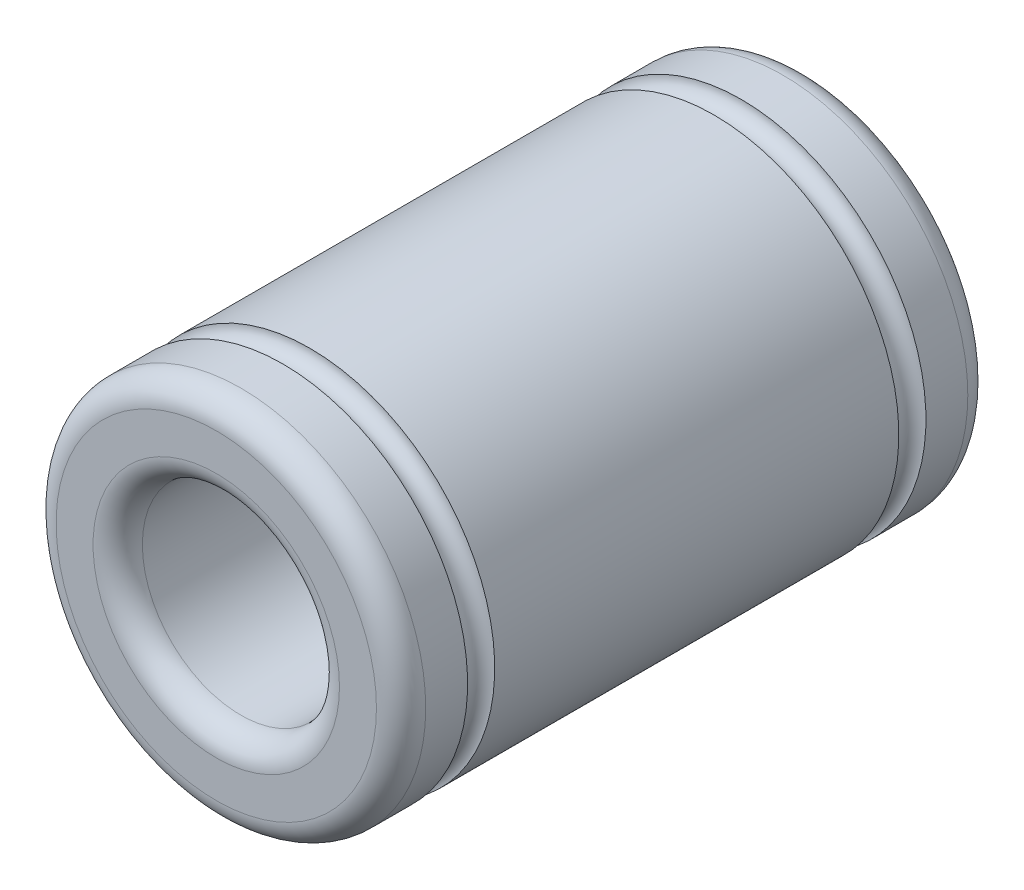
ISO-10303-21;
HEADER;
FILE_DESCRIPTION(('STEP AP214'),'2;1');
FILE_NAME('part.step','',(''),(''),'','','');
FILE_SCHEMA(('AUTOMOTIVE_DESIGN { 1 0 10303 214 1 1 1 1 }'));
ENDSEC;
DATA;
#1=APPLICATION_CONTEXT('core data for automotive mechanical design processes');
#2=APPLICATION_PROTOCOL_DEFINITION('international standard','automotive_design',2000,#1);
#3=PRODUCT_CONTEXT('',#1,'mechanical');
#4=PRODUCT('Part','Part','',(#3));
#5=PRODUCT_RELATED_PRODUCT_CATEGORY('part','',(#4));
#6=PRODUCT_DEFINITION_FORMATION('','',#4);
#7=PRODUCT_DEFINITION_CONTEXT('part definition',#1,'design');
#8=PRODUCT_DEFINITION('design','',#6,#7);
#9=PRODUCT_DEFINITION_SHAPE('','',#8);
#10=(LENGTH_UNIT() NAMED_UNIT(*) SI_UNIT(.MILLI.,.METRE.));
#11=(NAMED_UNIT(*) PLANE_ANGLE_UNIT() SI_UNIT($,.RADIAN.));
#12=(NAMED_UNIT(*) SI_UNIT($,.STERADIAN.) SOLID_ANGLE_UNIT());
#13=UNCERTAINTY_MEASURE_WITH_UNIT(LENGTH_MEASURE(1.E-05),#10,'distance_accuracy_value','');
#14=(GEOMETRIC_REPRESENTATION_CONTEXT(3) GLOBAL_UNCERTAINTY_ASSIGNED_CONTEXT((#13)) GLOBAL_UNIT_ASSIGNED_CONTEXT((#10,
#11,#12)) REPRESENTATION_CONTEXT('',''));
#15=CARTESIAN_POINT('',(0.,0.,0.));
#16=DIRECTION('',(0.,0.,1.));
#17=DIRECTION('',(1.,0.,0.));
#18=AXIS2_PLACEMENT_3D('',#15,#16,#17);
#19=CARTESIAN_POINT('',(0.,0.,24.));
#20=DIRECTION('',(0.,0.,-1.));
#21=DIRECTION('',(-1.,0.,0.));
#22=AXIS2_PLACEMENT_3D('',#19,#20,#21);
#23=CYLINDRICAL_SURFACE('',#22,7.5);
#24=CARTESIAN_POINT('',(0.,0.,23.));
#25=DIRECTION('',(0.,0.,1.));
#26=DIRECTION('',(1.,0.,0.));
#27=AXIS2_PLACEMENT_3D('',#24,#25,#26);
#28=CIRCLE('',#27,7.5);
#29=CARTESIAN_POINT('',(7.5,0.,23.));
#30=VERTEX_POINT('',#29);
#31=EDGE_CURVE('E71',#30,#30,#28,.F.);
#32=ORIENTED_EDGE('',*,*,#31,.T.);
#33=EDGE_LOOP('',(#32));
#34=FACE_BOUND('',#33,.T.);
#35=CARTESIAN_POINT('',(0.,0.,21.3));
#36=DIRECTION('',(0.,0.,-1.));
#37=DIRECTION('',(0.,1.,0.));
#38=AXIS2_PLACEMENT_3D('',#35,#36,#37);
#39=CIRCLE('',#38,7.5);
#40=CARTESIAN_POINT('',(0.,7.5,21.3));
#41=VERTEX_POINT('',#40);
#42=EDGE_CURVE('E48',#41,#41,#39,.T.);
#43=ORIENTED_EDGE('',*,*,#42,.F.);
#44=EDGE_LOOP('',(#43));
#45=FACE_BOUND('',#44,.T.);
#46=ADVANCED_FACE('F44',(#34,#45),#23,.T.);
#47=CARTESIAN_POINT('',(0.,0.,1.));
#48=DIRECTION('',(0.,0.,1.));
#49=DIRECTION('',(1.,0.,0.));
#50=AXIS2_PLACEMENT_3D('',#47,#48,#49);
#51=CIRCLE('',#50,7.5);
#52=CARTESIAN_POINT('',(7.5,0.,1.));
#53=VERTEX_POINT('',#52);
#54=EDGE_CURVE('E75',#53,#53,#51,.T.);
#55=ORIENTED_EDGE('',*,*,#54,.T.);
#56=EDGE_LOOP('',(#55));
#57=FACE_BOUND('',#56,.T.);
#58=CARTESIAN_POINT('',(0.,0.,2.7));
#59=DIRECTION('',(0.,0.,1.));
#60=DIRECTION('',(0.,-1.,0.));
#61=AXIS2_PLACEMENT_3D('',#58,#59,#60);
#62=CIRCLE('',#61,7.5);
#63=CARTESIAN_POINT('',(0.,-7.5,2.7));
#64=VERTEX_POINT('',#63);
#65=EDGE_CURVE('E61',#64,#64,#62,.T.);
#66=ORIENTED_EDGE('',*,*,#65,.F.);
#67=EDGE_LOOP('',(#66));
#68=FACE_BOUND('',#67,.T.);
#69=ADVANCED_FACE('F111',(#57,#68),#23,.T.);
#70=CARTESIAN_POINT('',(0.,0.,24.));
#71=DIRECTION('',(0.,0.,1.));
#72=DIRECTION('',(1.,0.,0.));
#73=AXIS2_PLACEMENT_3D('',#70,#71,#72);
#74=PLANE('',#73);
#75=CARTESIAN_POINT('',(0.,0.,24.));
#76=DIRECTION('',(0.,0.,1.));
#77=DIRECTION('',(1.,0.,0.));
#78=AXIS2_PLACEMENT_3D('',#75,#76,#77);
#79=CIRCLE('',#78,6.5);
#80=CARTESIAN_POINT('',(6.5,0.,24.));
#81=VERTEX_POINT('',#80);
#82=EDGE_CURVE('E57',#81,#81,#79,.T.);
#83=ORIENTED_EDGE('',*,*,#82,.T.);
#84=EDGE_LOOP('',(#83));
#85=FACE_BOUND('',#84,.T.);
#86=CARTESIAN_POINT('',(0.,0.,24.));
#87=DIRECTION('',(0.,0.,1.));
#88=DIRECTION('',(1.,0.,0.));
#89=AXIS2_PLACEMENT_3D('',#86,#87,#88);
#90=CIRCLE('',#89,5.);
#91=CARTESIAN_POINT('',(5.,0.,24.));
#92=VERTEX_POINT('',#91);
#93=EDGE_CURVE('E88',#92,#92,#90,.F.);
#94=ORIENTED_EDGE('',*,*,#93,.T.);
#95=EDGE_LOOP('',(#94));
#96=FACE_BOUND('',#95,.T.);
#97=ADVANCED_FACE('F93',(#85,#96),#74,.T.);
#98=CARTESIAN_POINT('',(0.,0.,0.));
#99=DIRECTION('',(0.,0.,1.));
#100=DIRECTION('',(1.,0.,0.));
#101=AXIS2_PLACEMENT_3D('',#98,#99,#100);
#102=PLANE('',#101);
#103=CARTESIAN_POINT('',(0.,0.,0.));
#104=DIRECTION('',(0.,0.,1.));
#105=DIRECTION('',(1.,0.,0.));
#106=AXIS2_PLACEMENT_3D('',#103,#104,#105);
#107=CIRCLE('',#106,6.5);
#108=CARTESIAN_POINT('',(6.5,0.,0.));
#109=VERTEX_POINT('',#108);
#110=EDGE_CURVE('E85',#109,#109,#107,.F.);
#111=ORIENTED_EDGE('',*,*,#110,.T.);
#112=EDGE_LOOP('',(#111));
#113=FACE_BOUND('',#112,.T.);
#114=CARTESIAN_POINT('',(0.,0.,0.));
#115=DIRECTION('',(0.,0.,1.));
#116=DIRECTION('',(1.,0.,0.));
#117=AXIS2_PLACEMENT_3D('',#114,#115,#116);
#118=CIRCLE('',#117,5.);
#119=CARTESIAN_POINT('',(5.,0.,0.));
#120=VERTEX_POINT('',#119);
#121=EDGE_CURVE('E80',#120,#120,#118,.T.);
#122=ORIENTED_EDGE('',*,*,#121,.T.);
#123=EDGE_LOOP('',(#122));
#124=FACE_BOUND('',#123,.T.);
#125=ADVANCED_FACE('F141',(#113,#124),#102,.F.);
#126=CARTESIAN_POINT('',(0.,0.,24.));
#127=DIRECTION('',(0.,0.,-1.));
#128=DIRECTION('',(-1.,0.,0.));
#129=AXIS2_PLACEMENT_3D('',#126,#127,#128);
#130=CYLINDRICAL_SURFACE('',#129,4.);
#131=CARTESIAN_POINT('',(0.,0.,1.));
#132=DIRECTION('',(0.,0.,1.));
#133=DIRECTION('',(1.,0.,0.));
#134=AXIS2_PLACEMENT_3D('',#131,#132,#133);
#135=CIRCLE('',#134,4.);
#136=CARTESIAN_POINT('',(4.,0.,1.));
#137=VERTEX_POINT('',#136);
#138=EDGE_CURVE('E12',#137,#137,#135,.F.);
#139=ORIENTED_EDGE('',*,*,#138,.T.);
#140=EDGE_LOOP('',(#139));
#141=FACE_BOUND('',#140,.T.);
#142=CARTESIAN_POINT('',(0.,0.,23.));
#143=DIRECTION('',(0.,0.,1.));
#144=DIRECTION('',(1.,0.,0.));
#145=AXIS2_PLACEMENT_3D('',#142,#143,#144);
#146=CIRCLE('',#145,4.);
#147=CARTESIAN_POINT('',(4.,0.,23.));
#148=VERTEX_POINT('',#147);
#149=EDGE_CURVE('E52',#148,#148,#146,.T.);
#150=ORIENTED_EDGE('',*,*,#149,.T.);
#151=EDGE_LOOP('',(#150));
#152=FACE_BOUND('',#151,.T.);
#153=ADVANCED_FACE('F107',(#141,#152),#130,.F.);
#154=CARTESIAN_POINT('',(0.,0.,1.));
#155=DIRECTION('',(0.,0.,1.));
#156=DIRECTION('',(1.,0.,0.));
#157=AXIS2_PLACEMENT_3D('',#154,#155,#156);
#158=TOROIDAL_SURFACE('',#157,6.5,1.);
#159=ORIENTED_EDGE('',*,*,#110,.F.);
#160=EDGE_LOOP('',(#159));
#161=FACE_BOUND('',#160,.T.);
#162=ORIENTED_EDGE('',*,*,#54,.F.);
#163=EDGE_LOOP('',(#162));
#164=FACE_BOUND('',#163,.T.);
#165=ADVANCED_FACE('F99',(#161,#164),#158,.T.);
#166=CARTESIAN_POINT('',(0.,0.,23.));
#167=DIRECTION('',(0.,0.,1.));
#168=DIRECTION('',(1.,0.,0.));
#169=AXIS2_PLACEMENT_3D('',#166,#167,#168);
#170=TOROIDAL_SURFACE('',#169,6.5,1.);
#171=ORIENTED_EDGE('',*,*,#31,.F.);
#172=EDGE_LOOP('',(#171));
#173=FACE_BOUND('',#172,.T.);
#174=ORIENTED_EDGE('',*,*,#82,.F.);
#175=EDGE_LOOP('',(#174));
#176=FACE_BOUND('',#175,.T.);
#177=ADVANCED_FACE('F96',(#173,#176),#170,.T.);
#178=CARTESIAN_POINT('',(0.,0.,1.));
#179=DIRECTION('',(0.,0.,1.));
#180=DIRECTION('',(1.,0.,0.));
#181=AXIS2_PLACEMENT_3D('',#178,#179,#180);
#182=TOROIDAL_SURFACE('',#181,5.,1.);
#183=ORIENTED_EDGE('',*,*,#138,.F.);
#184=EDGE_LOOP('',(#183));
#185=FACE_BOUND('',#184,.T.);
#186=ORIENTED_EDGE('',*,*,#121,.F.);
#187=EDGE_LOOP('',(#186));
#188=FACE_BOUND('',#187,.T.);
#189=ADVANCED_FACE('F98',(#185,#188),#182,.T.);
#190=CARTESIAN_POINT('',(0.,0.,23.));
#191=DIRECTION('',(0.,0.,1.));
#192=DIRECTION('',(1.,0.,0.));
#193=AXIS2_PLACEMENT_3D('',#190,#191,#192);
#194=TOROIDAL_SURFACE('',#193,5.,1.);
#195=ORIENTED_EDGE('',*,*,#93,.F.);
#196=EDGE_LOOP('',(#195));
#197=FACE_BOUND('',#196,.T.);
#198=ORIENTED_EDGE('',*,*,#149,.F.);
#199=EDGE_LOOP('',(#198));
#200=FACE_BOUND('',#199,.T.);
#201=ADVANCED_FACE('F46',(#197,#200),#194,.T.);
#202=CARTESIAN_POINT('',(0.,0.,3.25));
#203=DIRECTION('',(0.,0.,1.));
#204=DIRECTION('',(0.,-1.,0.));
#205=AXIS2_PLACEMENT_3D('',#202,#203,#204);
#206=TOROIDAL_SURFACE('',#205,7.5,0.549999999999999);
#207=ORIENTED_EDGE('',*,*,#65,.T.);
#208=EDGE_LOOP('',(#207));
#209=FACE_BOUND('',#208,.T.);
#210=CARTESIAN_POINT('',(0.,0.,3.8));
#211=DIRECTION('',(0.,0.,-1.));
#212=DIRECTION('',(0.,1.,0.));
#213=AXIS2_PLACEMENT_3D('',#210,#211,#212);
#214=CIRCLE('',#213,7.5);
#215=CARTESIAN_POINT('',(0.,7.5,3.8));
#216=VERTEX_POINT('',#215);
#217=EDGE_CURVE('E64',#216,#216,#214,.T.);
#218=ORIENTED_EDGE('',*,*,#217,.T.);
#219=EDGE_LOOP('',(#218));
#220=FACE_BOUND('',#219,.T.);
#221=ADVANCED_FACE('F122',(#209,#220),#206,.F.);
#222=ORIENTED_EDGE('',*,*,#217,.F.);
#223=EDGE_LOOP('',(#222));
#224=FACE_BOUND('',#223,.T.);
#225=CARTESIAN_POINT('',(0.,0.,20.2));
#226=DIRECTION('',(0.,0.,1.));
#227=DIRECTION('',(0.,-1.,0.));
#228=AXIS2_PLACEMENT_3D('',#225,#226,#227);
#229=CIRCLE('',#228,7.5);
#230=CARTESIAN_POINT('',(0.,-7.5,20.2));
#231=VERTEX_POINT('',#230);
#232=EDGE_CURVE('E66',#231,#231,#229,.T.);
#233=ORIENTED_EDGE('',*,*,#232,.F.);
#234=EDGE_LOOP('',(#233));
#235=FACE_BOUND('',#234,.T.);
#236=ADVANCED_FACE('F113',(#224,#235),#23,.T.);
#237=CARTESIAN_POINT('',(0.,0.,20.75));
#238=DIRECTION('',(0.,0.,1.));
#239=DIRECTION('',(0.,-1.,0.));
#240=AXIS2_PLACEMENT_3D('',#237,#238,#239);
#241=TOROIDAL_SURFACE('',#240,7.5,0.549999999999999);
#242=ORIENTED_EDGE('',*,*,#232,.T.);
#243=EDGE_LOOP('',(#242));
#244=FACE_BOUND('',#243,.T.);
#245=ORIENTED_EDGE('',*,*,#42,.T.);
#246=EDGE_LOOP('',(#245));
#247=FACE_BOUND('',#246,.T.);
#248=ADVANCED_FACE('F121',(#244,#247),#241,.F.);
#249=CLOSED_SHELL('',(#46,#69,#97,#125,#153,#165,#177,#189,#201,#221,#236,#248));
#250=MANIFOLD_SOLID_BREP('B2',#249);
#251=ADVANCED_BREP_SHAPE_REPRESENTATION('',(#18,#250),#14);
#252=SHAPE_DEFINITION_REPRESENTATION(#9,#251);
ENDSEC;
END-ISO-10303-21;
